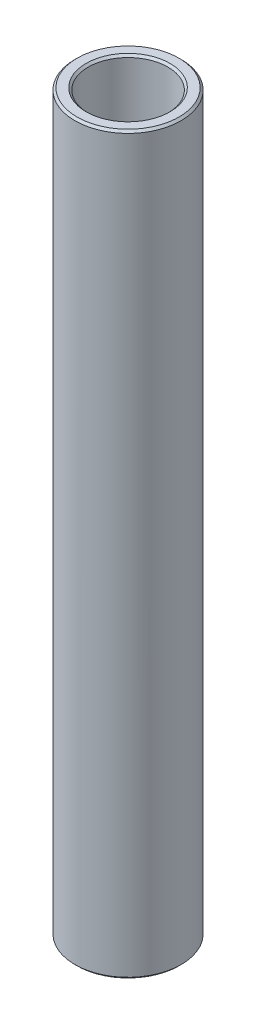
ISO-10303-21;
HEADER;
FILE_DESCRIPTION(('STEP AP214'),'2;1');
FILE_NAME('part.step','',(''),(''),'','','');
FILE_SCHEMA(('AUTOMOTIVE_DESIGN { 1 0 10303 214 1 1 1 1 }'));
ENDSEC;
DATA;
#1=APPLICATION_CONTEXT('core data for automotive mechanical design processes');
#2=APPLICATION_PROTOCOL_DEFINITION('international standard','automotive_design',2000,#1);
#3=PRODUCT_CONTEXT('',#1,'mechanical');
#4=PRODUCT('Part','Part','',(#3));
#5=PRODUCT_RELATED_PRODUCT_CATEGORY('part','',(#4));
#6=PRODUCT_DEFINITION_FORMATION('','',#4);
#7=PRODUCT_DEFINITION_CONTEXT('part definition',#1,'design');
#8=PRODUCT_DEFINITION('design','',#6,#7);
#9=PRODUCT_DEFINITION_SHAPE('','',#8);
#10=(LENGTH_UNIT() NAMED_UNIT(*) SI_UNIT(.MILLI.,.METRE.));
#11=(NAMED_UNIT(*) PLANE_ANGLE_UNIT() SI_UNIT($,.RADIAN.));
#12=(NAMED_UNIT(*) SI_UNIT($,.STERADIAN.) SOLID_ANGLE_UNIT());
#13=UNCERTAINTY_MEASURE_WITH_UNIT(LENGTH_MEASURE(1.E-05),#10,'distance_accuracy_value','');
#14=(GEOMETRIC_REPRESENTATION_CONTEXT(3) GLOBAL_UNCERTAINTY_ASSIGNED_CONTEXT((#13)) GLOBAL_UNIT_ASSIGNED_CONTEXT((#10,
#11,#12)) REPRESENTATION_CONTEXT('',''));
#15=CARTESIAN_POINT('',(0.,0.,0.));
#16=DIRECTION('',(0.,0.,1.));
#17=DIRECTION('',(1.,0.,0.));
#18=AXIS2_PLACEMENT_3D('',#15,#16,#17);
#19=CARTESIAN_POINT('',(6.35000000000029,70.6436949645927,0.));
#20=DIRECTION('',(8.94582928363965E-12,-1.,0.));
#21=DIRECTION('',(1.,8.94582928363965E-12,0.));
#22=AXIS2_PLACEMENT_3D('',#19,#20,#21);
#23=PLANE('',#22);
#24=CARTESIAN_POINT('',(-8.5209023926223E-11,70.6436949645359,0.));
#25=DIRECTION('',(8.94582928363965E-12,-1.,0.));
#26=DIRECTION('',(1.,8.94582928363965E-12,0.));
#27=AXIS2_PLACEMENT_3D('',#24,#25,#26);
#28=CIRCLE('',#27,5.01650000009231);
#29=CARTESIAN_POINT('',(5.0165000000071,70.6436949645808,0.));
#30=VERTEX_POINT('',#29);
#31=EDGE_CURVE('E10',#30,#30,#28,.F.);
#32=ORIENTED_EDGE('',*,*,#31,.T.);
#33=EDGE_LOOP('',(#32));
#34=FACE_BOUND('',#33,.T.);
#35=CARTESIAN_POINT('',(-8.5209023926223E-11,70.6436949645359,0.));
#36=DIRECTION('',(8.94582928363965E-12,-1.,0.));
#37=DIRECTION('',(1.,8.94582928363965E-12,0.));
#38=AXIS2_PLACEMENT_3D('',#35,#36,#37);
#39=CIRCLE('',#38,6.09600000009257);
#40=CARTESIAN_POINT('',(6.09600000000736,70.6436949645905,0.));
#41=VERTEX_POINT('',#40);
#42=EDGE_CURVE('E38',#41,#41,#39,.T.);
#43=ORIENTED_EDGE('',*,*,#42,.T.);
#44=EDGE_LOOP('',(#43));
#45=FACE_BOUND('',#44,.T.);
#46=ADVANCED_FACE('F31',(#34,#45),#23,.T.);
#47=CARTESIAN_POINT('',(0.,61.1186949645856,0.));
#48=DIRECTION('',(8.94582928363965E-12,-1.,0.));
#49=DIRECTION('',(1.,8.94582928363965E-12,0.));
#50=AXIS2_PLACEMENT_3D('',#47,#48,#49);
#51=CYLINDRICAL_SURFACE('',#50,4.76250000047823);
#52=CARTESIAN_POINT('',(-8.68961993358155E-10,158.254686028861,0.));
#53=DIRECTION('',(-8.94582928363951E-12,1.,0.));
#54=DIRECTION('',(-1.,-8.94582928363951E-12,0.));
#55=AXIS2_PLACEMENT_3D('',#52,#53,#54);
#56=CIRCLE('',#55,4.76250000047823);
#57=CARTESIAN_POINT('',(-4.7625000013472,158.254686028819,0.));
#58=VERTEX_POINT('',#57);
#59=EDGE_CURVE('E42',#58,#58,#56,.T.);
#60=ORIENTED_EDGE('',*,*,#59,.T.);
#61=EDGE_LOOP('',(#60));
#62=FACE_BOUND('',#61,.T.);
#63=CARTESIAN_POINT('',(-8.74812645608151E-11,70.89769496415,0.));
#64=DIRECTION('',(8.94582928363962E-12,-1.,0.));
#65=DIRECTION('',(1.,8.94582928363962E-12,0.));
#66=AXIS2_PLACEMENT_3D('',#63,#64,#65);
#67=CIRCLE('',#66,4.76250000047823);
#68=CARTESIAN_POINT('',(4.76250000039075,70.8976949641926,0.));
#69=VERTEX_POINT('',#68);
#70=EDGE_CURVE('E46',#69,#69,#67,.T.);
#71=ORIENTED_EDGE('',*,*,#70,.T.);
#72=EDGE_LOOP('',(#71));
#73=FACE_BOUND('',#72,.T.);
#74=ADVANCED_FACE('F75',(#62,#73),#51,.F.);
#75=CARTESIAN_POINT('',(4.76250000000001,158.50868602929,0.));
#76=DIRECTION('',(-8.94582928363965E-12,1.,0.));
#77=DIRECTION('',(-1.,-8.94582928363965E-12,0.));
#78=AXIS2_PLACEMENT_3D('',#75,#76,#77);
#79=PLANE('',#78);
#80=CARTESIAN_POINT('',(-8.71234233999652E-10,158.508686029247,0.));
#81=DIRECTION('',(-8.94582928363965E-12,1.,0.));
#82=DIRECTION('',(-1.,-8.94582928363965E-12,0.));
#83=AXIS2_PLACEMENT_3D('',#80,#81,#82);
#84=CIRCLE('',#83,6.09600000086442);
#85=CARTESIAN_POINT('',(-6.09600000173566,158.508686029193,0.));
#86=VERTEX_POINT('',#85);
#87=EDGE_CURVE('E51',#86,#86,#84,.T.);
#88=ORIENTED_EDGE('',*,*,#87,.T.);
#89=EDGE_LOOP('',(#88));
#90=FACE_BOUND('',#89,.T.);
#91=CARTESIAN_POINT('',(-8.71234233999652E-10,158.508686029247,0.));
#92=DIRECTION('',(-8.94582928363965E-12,1.,0.));
#93=DIRECTION('',(-1.,-8.94582928363965E-12,0.));
#94=AXIS2_PLACEMENT_3D('',#91,#92,#93);
#95=CIRCLE('',#94,5.01650000086415);
#96=CARTESIAN_POINT('',(-5.01650000173538,158.508686029202,0.));
#97=VERTEX_POINT('',#96);
#98=EDGE_CURVE('E54',#97,#97,#95,.F.);
#99=ORIENTED_EDGE('',*,*,#98,.T.);
#100=EDGE_LOOP('',(#99));
#101=FACE_BOUND('',#100,.T.);
#102=ADVANCED_FACE('F80',(#90,#101),#79,.T.);
#103=CARTESIAN_POINT('',(0.,61.1186949645856,0.));
#104=DIRECTION('',(8.94582928363965E-12,-1.,0.));
#105=DIRECTION('',(1.,8.94582928363965E-12,0.));
#106=AXIS2_PLACEMENT_3D('',#103,#104,#105);
#107=CYLINDRICAL_SURFACE('',#106,6.35000000047851);
#108=CARTESIAN_POINT('',(-8.6896199336506E-10,158.254686029633,0.));
#109=DIRECTION('',(-8.94582928363977E-12,1.,0.));
#110=DIRECTION('',(-1.,-8.94582928363977E-12,0.));
#111=AXIS2_PLACEMENT_3D('',#108,#109,#110);
#112=CIRCLE('',#111,6.35000000047851);
#113=CARTESIAN_POINT('',(-6.35000000134747,158.254686029576,0.));
#114=VERTEX_POINT('',#113);
#115=EDGE_CURVE('E57',#114,#114,#112,.F.);
#116=ORIENTED_EDGE('',*,*,#115,.T.);
#117=EDGE_LOOP('',(#116));
#118=FACE_BOUND('',#117,.T.);
#119=CARTESIAN_POINT('',(-8.74812645677199E-11,70.8976949649219,0.));
#120=DIRECTION('',(8.94582928363962E-12,-1.,0.));
#121=DIRECTION('',(1.,8.94582928363962E-12,0.));
#122=AXIS2_PLACEMENT_3D('',#119,#120,#121);
#123=CIRCLE('',#122,6.35000000047851);
#124=CARTESIAN_POINT('',(6.35000000039102,70.8976949649787,0.));
#125=VERTEX_POINT('',#124);
#126=EDGE_CURVE('E60',#125,#125,#123,.F.);
#127=ORIENTED_EDGE('',*,*,#126,.T.);
#128=EDGE_LOOP('',(#127));
#129=FACE_BOUND('',#128,.T.);
#130=ADVANCED_FACE('F64',(#118,#129),#107,.T.);
#131=CARTESIAN_POINT('',(-8.6896199336506E-10,158.254686029633,0.));
#132=DIRECTION('',(8.94582928363977E-12,-1.,0.));
#133=DIRECTION('',(1.,8.94582928363977E-12,0.));
#134=AXIS2_PLACEMENT_3D('',#131,#132,#133);
#135=CONICAL_SURFACE('',#134,6.35000000047851,0.785398163397493);
#136=ORIENTED_EDGE('',*,*,#87,.F.);
#137=EDGE_LOOP('',(#136));
#138=FACE_BOUND('',#137,.T.);
#139=ORIENTED_EDGE('',*,*,#115,.F.);
#140=EDGE_LOOP('',(#139));
#141=FACE_BOUND('',#140,.T.);
#142=ADVANCED_FACE('F85',(#138,#141),#135,.T.);
#143=CARTESIAN_POINT('',(-8.71234233999652E-10,158.508686029247,0.));
#144=DIRECTION('',(-8.94582928363951E-12,1.,0.));
#145=DIRECTION('',(-1.,-8.94582928363951E-12,0.));
#146=AXIS2_PLACEMENT_3D('',#143,#144,#145);
#147=CONICAL_SURFACE('',#146,5.01650000086415,0.785398163397435);
#148=ORIENTED_EDGE('',*,*,#59,.F.);
#149=EDGE_LOOP('',(#148));
#150=FACE_BOUND('',#149,.T.);
#151=ORIENTED_EDGE('',*,*,#98,.F.);
#152=EDGE_LOOP('',(#151));
#153=FACE_BOUND('',#152,.T.);
#154=ADVANCED_FACE('F72',(#150,#153),#147,.F.);
#155=CARTESIAN_POINT('',(-8.74812645608151E-11,70.89769496415,0.));
#156=DIRECTION('',(8.94582928363962E-12,-1.,0.));
#157=DIRECTION('',(1.,8.94582928363962E-12,0.));
#158=AXIS2_PLACEMENT_3D('',#155,#156,#157);
#159=CONICAL_SURFACE('',#158,4.76250000047823,0.785398163397435);
#160=ORIENTED_EDGE('',*,*,#31,.F.);
#161=EDGE_LOOP('',(#160));
#162=FACE_BOUND('',#161,.T.);
#163=ORIENTED_EDGE('',*,*,#70,.F.);
#164=EDGE_LOOP('',(#163));
#165=FACE_BOUND('',#164,.T.);
#166=ADVANCED_FACE('F68',(#162,#165),#159,.F.);
#167=CARTESIAN_POINT('',(-8.5209023926223E-11,70.6436949645359,0.));
#168=DIRECTION('',(-8.94582928363962E-12,1.,0.));
#169=DIRECTION('',(-1.,-8.94582928363962E-12,0.));
#170=AXIS2_PLACEMENT_3D('',#167,#168,#169);
#171=CONICAL_SURFACE('',#170,6.09600000009258,0.785398163397445);
#172=ORIENTED_EDGE('',*,*,#126,.F.);
#173=EDGE_LOOP('',(#172));
#174=FACE_BOUND('',#173,.T.);
#175=ORIENTED_EDGE('',*,*,#42,.F.);
#176=EDGE_LOOP('',(#175));
#177=FACE_BOUND('',#176,.T.);
#178=ADVANCED_FACE('F33',(#174,#177),#171,.T.);
#179=CLOSED_SHELL('',(#46,#74,#102,#130,#142,#154,#166,#178));
#180=MANIFOLD_SOLID_BREP('B2',#179);
#181=ADVANCED_BREP_SHAPE_REPRESENTATION('',(#18,#180),#14);
#182=SHAPE_DEFINITION_REPRESENTATION(#9,#181);
ENDSEC;
END-ISO-10303-21;
